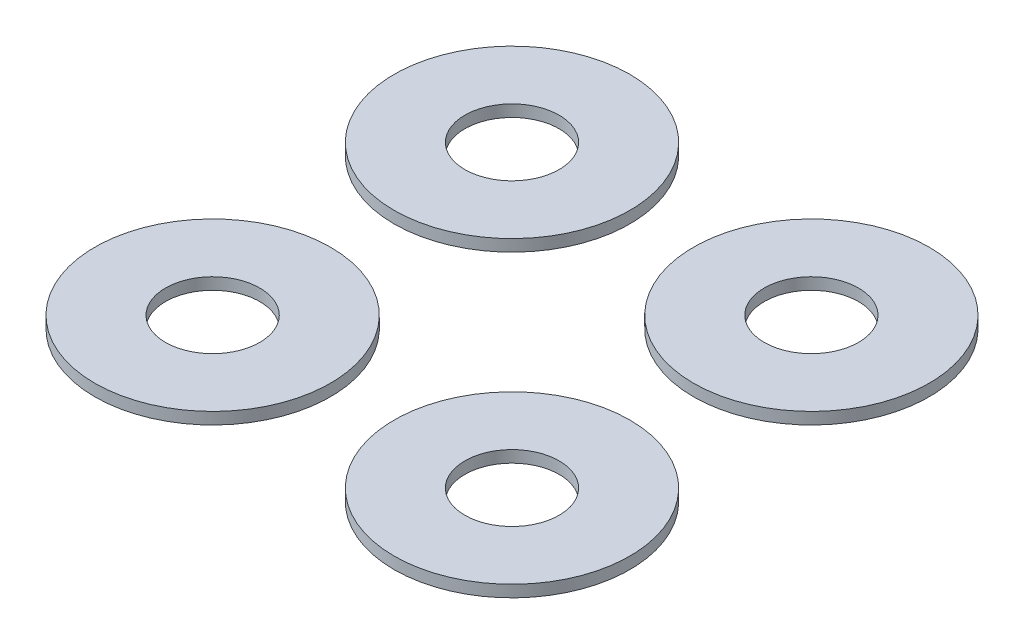
ISO-10303-21;
HEADER;
FILE_DESCRIPTION(('STEP AP214'),'2;1');
FILE_NAME('part.step','',(''),(''),'','','');
FILE_SCHEMA(('AUTOMOTIVE_DESIGN { 1 0 10303 214 1 1 1 1 }'));
ENDSEC;
DATA;
#1=APPLICATION_CONTEXT('core data for automotive mechanical design processes');
#2=APPLICATION_PROTOCOL_DEFINITION('international standard','automotive_design',2000,#1);
#3=PRODUCT_CONTEXT('',#1,'mechanical');
#4=PRODUCT('Part','Part','',(#3));
#5=PRODUCT_RELATED_PRODUCT_CATEGORY('part','',(#4));
#6=PRODUCT_DEFINITION_FORMATION('','',#4);
#7=PRODUCT_DEFINITION_CONTEXT('part definition',#1,'design');
#8=PRODUCT_DEFINITION('design','',#6,#7);
#9=PRODUCT_DEFINITION_SHAPE('','',#8);
#10=(LENGTH_UNIT() NAMED_UNIT(*) SI_UNIT(.MILLI.,.METRE.));
#11=(NAMED_UNIT(*) PLANE_ANGLE_UNIT() SI_UNIT($,.RADIAN.));
#12=(NAMED_UNIT(*) SI_UNIT($,.STERADIAN.) SOLID_ANGLE_UNIT());
#13=UNCERTAINTY_MEASURE_WITH_UNIT(LENGTH_MEASURE(1.E-05),#10,'distance_accuracy_value','');
#14=(GEOMETRIC_REPRESENTATION_CONTEXT(3) GLOBAL_UNCERTAINTY_ASSIGNED_CONTEXT((#13)) GLOBAL_UNIT_ASSIGNED_CONTEXT((#10,
#11,#12)) REPRESENTATION_CONTEXT('',''));
#15=CARTESIAN_POINT('',(0.,0.,0.));
#16=DIRECTION('',(0.,0.,1.));
#17=DIRECTION('',(1.,0.,0.));
#18=AXIS2_PLACEMENT_3D('',#15,#16,#17);
#19=CARTESIAN_POINT('',(0.,0.1,0.));
#20=DIRECTION('',(0.,1.,0.));
#21=DIRECTION('',(0.,0.,1.));
#22=AXIS2_PLACEMENT_3D('',#19,#20,#21);
#23=PLANE('',#22);
#24=CARTESIAN_POINT('',(0.,0.1,0.));
#25=DIRECTION('',(0.,1.,0.));
#26=DIRECTION('',(0.,0.,1.));
#27=AXIS2_PLACEMENT_3D('',#24,#25,#26);
#28=CIRCLE('',#27,1.);
#29=CARTESIAN_POINT('',(0.,0.1,1.));
#30=VERTEX_POINT('',#29);
#31=EDGE_CURVE('P0_E10',#30,#30,#28,.T.);
#32=ORIENTED_EDGE('',*,*,#31,.T.);
#33=EDGE_LOOP('',(#32));
#34=FACE_BOUND('',#33,.T.);
#35=CARTESIAN_POINT('',(0.,0.1,0.));
#36=DIRECTION('',(0.,1.,0.));
#37=DIRECTION('',(0.,0.,1.));
#38=AXIS2_PLACEMENT_3D('',#35,#36,#37);
#39=CIRCLE('',#38,0.4);
#40=CARTESIAN_POINT('',(0.,0.1,0.4));
#41=VERTEX_POINT('',#40);
#42=EDGE_CURVE('P0_E26',#41,#41,#39,.T.);
#43=ORIENTED_EDGE('',*,*,#42,.F.);
#44=EDGE_LOOP('',(#43));
#45=FACE_BOUND('',#44,.T.);
#46=ADVANCED_FACE('P0_F15',(#34,#45),#23,.T.);
#47=CARTESIAN_POINT('',(0.,0.,0.));
#48=DIRECTION('',(0.,1.,0.));
#49=DIRECTION('',(0.,0.,1.));
#50=AXIS2_PLACEMENT_3D('',#47,#48,#49);
#51=PLANE('',#50);
#52=CARTESIAN_POINT('',(0.,0.,0.));
#53=DIRECTION('',(0.,1.,0.));
#54=DIRECTION('',(0.,0.,1.));
#55=AXIS2_PLACEMENT_3D('',#52,#53,#54);
#56=CIRCLE('',#55,1.);
#57=CARTESIAN_POINT('',(0.,0.,1.));
#58=VERTEX_POINT('',#57);
#59=EDGE_CURVE('P0_E19',#58,#58,#56,.T.);
#60=ORIENTED_EDGE('',*,*,#59,.F.);
#61=EDGE_LOOP('',(#60));
#62=FACE_BOUND('',#61,.T.);
#63=CARTESIAN_POINT('',(0.,0.,0.));
#64=DIRECTION('',(0.,1.,0.));
#65=DIRECTION('',(0.,0.,1.));
#66=AXIS2_PLACEMENT_3D('',#63,#64,#65);
#67=CIRCLE('',#66,0.4);
#68=CARTESIAN_POINT('',(0.,0.,0.4));
#69=VERTEX_POINT('',#68);
#70=EDGE_CURVE('P0_E28',#69,#69,#67,.T.);
#71=ORIENTED_EDGE('',*,*,#70,.T.);
#72=EDGE_LOOP('',(#71));
#73=FACE_BOUND('',#72,.T.);
#74=ADVANCED_FACE('P0_F38',(#62,#73),#51,.F.);
#75=CARTESIAN_POINT('',(0.,0.1,0.));
#76=DIRECTION('',(0.,-1.,0.));
#77=DIRECTION('',(0.,0.,-1.));
#78=AXIS2_PLACEMENT_3D('',#75,#76,#77);
#79=CYLINDRICAL_SURFACE('',#78,1.);
#80=ORIENTED_EDGE('',*,*,#31,.F.);
#81=EDGE_LOOP('',(#80));
#82=FACE_BOUND('',#81,.T.);
#83=ORIENTED_EDGE('',*,*,#59,.T.);
#84=EDGE_LOOP('',(#83));
#85=FACE_BOUND('',#84,.T.);
#86=ADVANCED_FACE('P0_F17',(#82,#85),#79,.T.);
#87=CARTESIAN_POINT('',(0.,0.1,0.));
#88=DIRECTION('',(0.,-1.,0.));
#89=DIRECTION('',(0.,0.,-1.));
#90=AXIS2_PLACEMENT_3D('',#87,#88,#89);
#91=CYLINDRICAL_SURFACE('',#90,0.4);
#92=ORIENTED_EDGE('',*,*,#42,.T.);
#93=EDGE_LOOP('',(#92));
#94=FACE_BOUND('',#93,.T.);
#95=ORIENTED_EDGE('',*,*,#70,.F.);
#96=EDGE_LOOP('',(#95));
#97=FACE_BOUND('',#96,.T.);
#98=ADVANCED_FACE('P0_F34',(#94,#97),#91,.F.);
#99=CLOSED_SHELL('',(#46,#74,#86,#98));
#100=MANIFOLD_SOLID_BREP('P0_B1',#99);
#101=CARTESIAN_POINT('',(0.,0.1,-2.54));
#102=DIRECTION('',(0.,1.,0.));
#103=DIRECTION('',(0.,0.,1.));
#104=AXIS2_PLACEMENT_3D('',#101,#102,#103);
#105=PLANE('',#104);
#106=CARTESIAN_POINT('',(0.,0.1,-2.54));
#107=DIRECTION('',(0.,1.,0.));
#108=DIRECTION('',(0.,0.,1.));
#109=AXIS2_PLACEMENT_3D('',#106,#107,#108);
#110=CIRCLE('',#109,1.);
#111=CARTESIAN_POINT('',(0.,0.1,-1.54));
#112=VERTEX_POINT('',#111);
#113=EDGE_CURVE('P1_E10',#112,#112,#110,.T.);
#114=ORIENTED_EDGE('',*,*,#113,.T.);
#115=EDGE_LOOP('',(#114));
#116=FACE_BOUND('',#115,.T.);
#117=CARTESIAN_POINT('',(0.,0.1,-2.54));
#118=DIRECTION('',(0.,1.,0.));
#119=DIRECTION('',(0.,0.,1.));
#120=AXIS2_PLACEMENT_3D('',#117,#118,#119);
#121=CIRCLE('',#120,0.4);
#122=CARTESIAN_POINT('',(0.,0.1,-2.14));
#123=VERTEX_POINT('',#122);
#124=EDGE_CURVE('P1_E26',#123,#123,#121,.T.);
#125=ORIENTED_EDGE('',*,*,#124,.F.);
#126=EDGE_LOOP('',(#125));
#127=FACE_BOUND('',#126,.T.);
#128=ADVANCED_FACE('P1_F15',(#116,#127),#105,.T.);
#129=CARTESIAN_POINT('',(0.,0.,-2.54));
#130=DIRECTION('',(0.,1.,0.));
#131=DIRECTION('',(0.,0.,1.));
#132=AXIS2_PLACEMENT_3D('',#129,#130,#131);
#133=PLANE('',#132);
#134=CARTESIAN_POINT('',(0.,0.,-2.54));
#135=DIRECTION('',(0.,1.,0.));
#136=DIRECTION('',(0.,0.,1.));
#137=AXIS2_PLACEMENT_3D('',#134,#135,#136);
#138=CIRCLE('',#137,1.);
#139=CARTESIAN_POINT('',(0.,0.,-1.54));
#140=VERTEX_POINT('',#139);
#141=EDGE_CURVE('P1_E19',#140,#140,#138,.T.);
#142=ORIENTED_EDGE('',*,*,#141,.F.);
#143=EDGE_LOOP('',(#142));
#144=FACE_BOUND('',#143,.T.);
#145=CARTESIAN_POINT('',(0.,0.,-2.54));
#146=DIRECTION('',(0.,1.,0.));
#147=DIRECTION('',(0.,0.,1.));
#148=AXIS2_PLACEMENT_3D('',#145,#146,#147);
#149=CIRCLE('',#148,0.4);
#150=CARTESIAN_POINT('',(0.,0.,-2.14));
#151=VERTEX_POINT('',#150);
#152=EDGE_CURVE('P1_E28',#151,#151,#149,.T.);
#153=ORIENTED_EDGE('',*,*,#152,.T.);
#154=EDGE_LOOP('',(#153));
#155=FACE_BOUND('',#154,.T.);
#156=ADVANCED_FACE('P1_F38',(#144,#155),#133,.F.);
#157=CARTESIAN_POINT('',(0.,0.1,-2.54));
#158=DIRECTION('',(0.,-1.,0.));
#159=DIRECTION('',(0.,0.,-1.));
#160=AXIS2_PLACEMENT_3D('',#157,#158,#159);
#161=CYLINDRICAL_SURFACE('',#160,1.);
#162=ORIENTED_EDGE('',*,*,#113,.F.);
#163=EDGE_LOOP('',(#162));
#164=FACE_BOUND('',#163,.T.);
#165=ORIENTED_EDGE('',*,*,#141,.T.);
#166=EDGE_LOOP('',(#165));
#167=FACE_BOUND('',#166,.T.);
#168=ADVANCED_FACE('P1_F17',(#164,#167),#161,.T.);
#169=CARTESIAN_POINT('',(0.,0.1,-2.54));
#170=DIRECTION('',(0.,-1.,0.));
#171=DIRECTION('',(0.,0.,-1.));
#172=AXIS2_PLACEMENT_3D('',#169,#170,#171);
#173=CYLINDRICAL_SURFACE('',#172,0.4);
#174=ORIENTED_EDGE('',*,*,#124,.T.);
#175=EDGE_LOOP('',(#174));
#176=FACE_BOUND('',#175,.T.);
#177=ORIENTED_EDGE('',*,*,#152,.F.);
#178=EDGE_LOOP('',(#177));
#179=FACE_BOUND('',#178,.T.);
#180=ADVANCED_FACE('P1_F34',(#176,#179),#173,.F.);
#181=CLOSED_SHELL('',(#128,#156,#168,#180));
#182=MANIFOLD_SOLID_BREP('P1_B1',#181);
#183=CARTESIAN_POINT('',(2.54,0.1,-2.54));
#184=DIRECTION('',(0.,1.,0.));
#185=DIRECTION('',(0.,0.,1.));
#186=AXIS2_PLACEMENT_3D('',#183,#184,#185);
#187=PLANE('',#186);
#188=CARTESIAN_POINT('',(2.54,0.1,-2.54));
#189=DIRECTION('',(0.,1.,0.));
#190=DIRECTION('',(0.,0.,1.));
#191=AXIS2_PLACEMENT_3D('',#188,#189,#190);
#192=CIRCLE('',#191,1.);
#193=CARTESIAN_POINT('',(2.54,0.1,-1.54));
#194=VERTEX_POINT('',#193);
#195=EDGE_CURVE('P2_E10',#194,#194,#192,.T.);
#196=ORIENTED_EDGE('',*,*,#195,.T.);
#197=EDGE_LOOP('',(#196));
#198=FACE_BOUND('',#197,.T.);
#199=CARTESIAN_POINT('',(2.54,0.1,-2.54));
#200=DIRECTION('',(0.,1.,0.));
#201=DIRECTION('',(0.,0.,1.));
#202=AXIS2_PLACEMENT_3D('',#199,#200,#201);
#203=CIRCLE('',#202,0.4);
#204=CARTESIAN_POINT('',(2.54,0.1,-2.14));
#205=VERTEX_POINT('',#204);
#206=EDGE_CURVE('P2_E26',#205,#205,#203,.T.);
#207=ORIENTED_EDGE('',*,*,#206,.F.);
#208=EDGE_LOOP('',(#207));
#209=FACE_BOUND('',#208,.T.);
#210=ADVANCED_FACE('P2_F15',(#198,#209),#187,.T.);
#211=CARTESIAN_POINT('',(2.54,0.,-2.54));
#212=DIRECTION('',(0.,1.,0.));
#213=DIRECTION('',(0.,0.,1.));
#214=AXIS2_PLACEMENT_3D('',#211,#212,#213);
#215=PLANE('',#214);
#216=CARTESIAN_POINT('',(2.54,0.,-2.54));
#217=DIRECTION('',(0.,1.,0.));
#218=DIRECTION('',(0.,0.,1.));
#219=AXIS2_PLACEMENT_3D('',#216,#217,#218);
#220=CIRCLE('',#219,1.);
#221=CARTESIAN_POINT('',(2.54,0.,-1.54));
#222=VERTEX_POINT('',#221);
#223=EDGE_CURVE('P2_E19',#222,#222,#220,.T.);
#224=ORIENTED_EDGE('',*,*,#223,.F.);
#225=EDGE_LOOP('',(#224));
#226=FACE_BOUND('',#225,.T.);
#227=CARTESIAN_POINT('',(2.54,0.,-2.54));
#228=DIRECTION('',(0.,1.,0.));
#229=DIRECTION('',(0.,0.,1.));
#230=AXIS2_PLACEMENT_3D('',#227,#228,#229);
#231=CIRCLE('',#230,0.4);
#232=CARTESIAN_POINT('',(2.54,0.,-2.14));
#233=VERTEX_POINT('',#232);
#234=EDGE_CURVE('P2_E28',#233,#233,#231,.T.);
#235=ORIENTED_EDGE('',*,*,#234,.T.);
#236=EDGE_LOOP('',(#235));
#237=FACE_BOUND('',#236,.T.);
#238=ADVANCED_FACE('P2_F38',(#226,#237),#215,.F.);
#239=CARTESIAN_POINT('',(2.54,0.1,-2.54));
#240=DIRECTION('',(0.,-1.,0.));
#241=DIRECTION('',(0.,0.,-1.));
#242=AXIS2_PLACEMENT_3D('',#239,#240,#241);
#243=CYLINDRICAL_SURFACE('',#242,1.);
#244=ORIENTED_EDGE('',*,*,#195,.F.);
#245=EDGE_LOOP('',(#244));
#246=FACE_BOUND('',#245,.T.);
#247=ORIENTED_EDGE('',*,*,#223,.T.);
#248=EDGE_LOOP('',(#247));
#249=FACE_BOUND('',#248,.T.);
#250=ADVANCED_FACE('P2_F17',(#246,#249),#243,.T.);
#251=CARTESIAN_POINT('',(2.54,0.1,-2.54));
#252=DIRECTION('',(0.,-1.,0.));
#253=DIRECTION('',(0.,0.,-1.));
#254=AXIS2_PLACEMENT_3D('',#251,#252,#253);
#255=CYLINDRICAL_SURFACE('',#254,0.4);
#256=ORIENTED_EDGE('',*,*,#206,.T.);
#257=EDGE_LOOP('',(#256));
#258=FACE_BOUND('',#257,.T.);
#259=ORIENTED_EDGE('',*,*,#234,.F.);
#260=EDGE_LOOP('',(#259));
#261=FACE_BOUND('',#260,.T.);
#262=ADVANCED_FACE('P2_F34',(#258,#261),#255,.F.);
#263=CLOSED_SHELL('',(#210,#238,#250,#262));
#264=MANIFOLD_SOLID_BREP('P2_B1',#263);
#265=CARTESIAN_POINT('',(2.54,0.1,0.));
#266=DIRECTION('',(0.,1.,0.));
#267=DIRECTION('',(0.,0.,1.));
#268=AXIS2_PLACEMENT_3D('',#265,#266,#267);
#269=PLANE('',#268);
#270=CARTESIAN_POINT('',(2.54,0.1,0.));
#271=DIRECTION('',(0.,1.,0.));
#272=DIRECTION('',(0.,0.,1.));
#273=AXIS2_PLACEMENT_3D('',#270,#271,#272);
#274=CIRCLE('',#273,1.);
#275=CARTESIAN_POINT('',(2.54,0.1,1.));
#276=VERTEX_POINT('',#275);
#277=EDGE_CURVE('P3_E10',#276,#276,#274,.T.);
#278=ORIENTED_EDGE('',*,*,#277,.T.);
#279=EDGE_LOOP('',(#278));
#280=FACE_BOUND('',#279,.T.);
#281=CARTESIAN_POINT('',(2.54,0.1,0.));
#282=DIRECTION('',(0.,1.,0.));
#283=DIRECTION('',(0.,0.,1.));
#284=AXIS2_PLACEMENT_3D('',#281,#282,#283);
#285=CIRCLE('',#284,0.4);
#286=CARTESIAN_POINT('',(2.54,0.1,0.4));
#287=VERTEX_POINT('',#286);
#288=EDGE_CURVE('P3_E26',#287,#287,#285,.T.);
#289=ORIENTED_EDGE('',*,*,#288,.F.);
#290=EDGE_LOOP('',(#289));
#291=FACE_BOUND('',#290,.T.);
#292=ADVANCED_FACE('P3_F15',(#280,#291),#269,.T.);
#293=CARTESIAN_POINT('',(2.54,0.,0.));
#294=DIRECTION('',(0.,1.,0.));
#295=DIRECTION('',(0.,0.,1.));
#296=AXIS2_PLACEMENT_3D('',#293,#294,#295);
#297=PLANE('',#296);
#298=CARTESIAN_POINT('',(2.54,0.,0.));
#299=DIRECTION('',(0.,1.,0.));
#300=DIRECTION('',(0.,0.,1.));
#301=AXIS2_PLACEMENT_3D('',#298,#299,#300);
#302=CIRCLE('',#301,1.);
#303=CARTESIAN_POINT('',(2.54,0.,1.));
#304=VERTEX_POINT('',#303);
#305=EDGE_CURVE('P3_E19',#304,#304,#302,.T.);
#306=ORIENTED_EDGE('',*,*,#305,.F.);
#307=EDGE_LOOP('',(#306));
#308=FACE_BOUND('',#307,.T.);
#309=CARTESIAN_POINT('',(2.54,0.,0.));
#310=DIRECTION('',(0.,1.,0.));
#311=DIRECTION('',(0.,0.,1.));
#312=AXIS2_PLACEMENT_3D('',#309,#310,#311);
#313=CIRCLE('',#312,0.4);
#314=CARTESIAN_POINT('',(2.54,0.,0.4));
#315=VERTEX_POINT('',#314);
#316=EDGE_CURVE('P3_E28',#315,#315,#313,.T.);
#317=ORIENTED_EDGE('',*,*,#316,.T.);
#318=EDGE_LOOP('',(#317));
#319=FACE_BOUND('',#318,.T.);
#320=ADVANCED_FACE('P3_F38',(#308,#319),#297,.F.);
#321=CARTESIAN_POINT('',(2.54,0.1,0.));
#322=DIRECTION('',(0.,-1.,0.));
#323=DIRECTION('',(0.,0.,-1.));
#324=AXIS2_PLACEMENT_3D('',#321,#322,#323);
#325=CYLINDRICAL_SURFACE('',#324,1.);
#326=ORIENTED_EDGE('',*,*,#277,.F.);
#327=EDGE_LOOP('',(#326));
#328=FACE_BOUND('',#327,.T.);
#329=ORIENTED_EDGE('',*,*,#305,.T.);
#330=EDGE_LOOP('',(#329));
#331=FACE_BOUND('',#330,.T.);
#332=ADVANCED_FACE('P3_F17',(#328,#331),#325,.T.);
#333=CARTESIAN_POINT('',(2.54,0.1,0.));
#334=DIRECTION('',(0.,-1.,0.));
#335=DIRECTION('',(0.,0.,-1.));
#336=AXIS2_PLACEMENT_3D('',#333,#334,#335);
#337=CYLINDRICAL_SURFACE('',#336,0.4);
#338=ORIENTED_EDGE('',*,*,#288,.T.);
#339=EDGE_LOOP('',(#338));
#340=FACE_BOUND('',#339,.T.);
#341=ORIENTED_EDGE('',*,*,#316,.F.);
#342=EDGE_LOOP('',(#341));
#343=FACE_BOUND('',#342,.T.);
#344=ADVANCED_FACE('P3_F34',(#340,#343),#337,.F.);
#345=CLOSED_SHELL('',(#292,#320,#332,#344));
#346=MANIFOLD_SOLID_BREP('P3_B1',#345);
#347=ADVANCED_BREP_SHAPE_REPRESENTATION('',(#18,#100,#182,#264,#346),#14);
#348=SHAPE_DEFINITION_REPRESENTATION(#9,#347);
ENDSEC;
END-ISO-10303-21;
